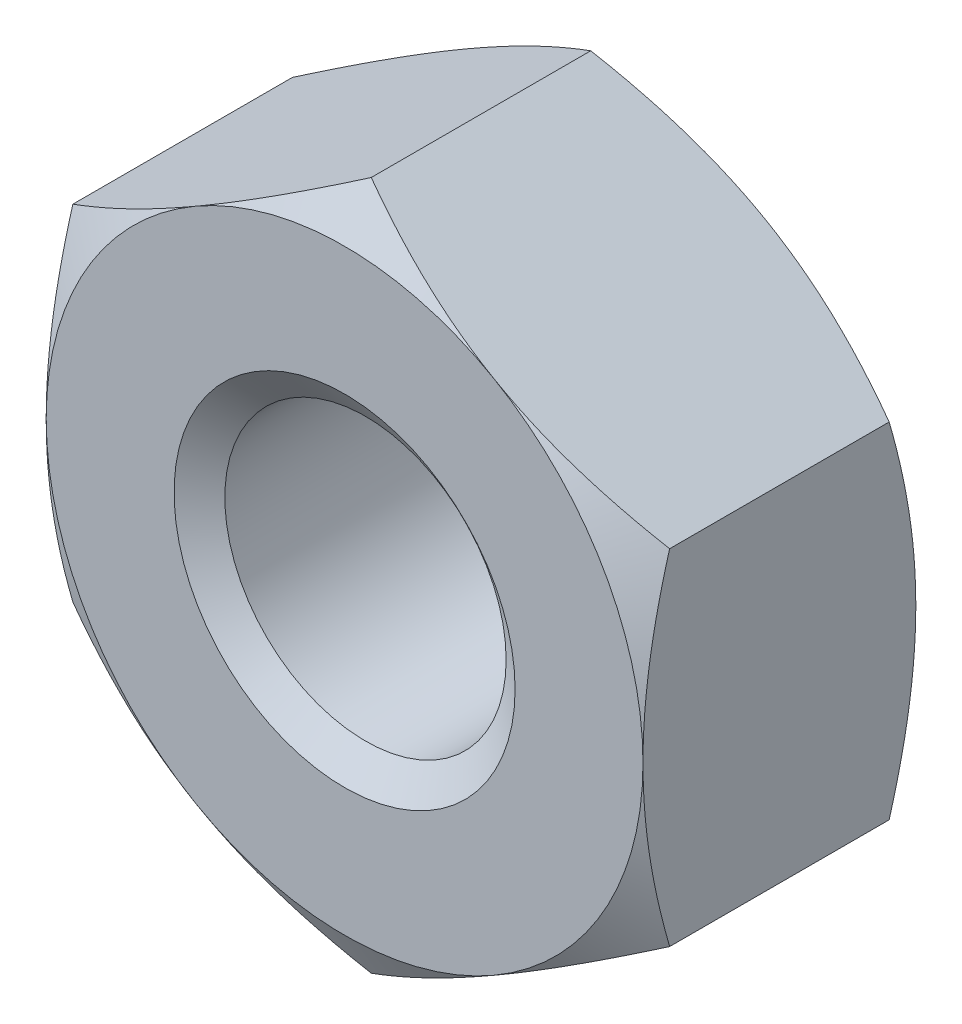
ISO-10303-21;
HEADER;
FILE_DESCRIPTION(('STEP AP214'),'2;1');
FILE_NAME('part.step','',(''),(''),'','','');
FILE_SCHEMA(('AUTOMOTIVE_DESIGN { 1 0 10303 214 1 1 1 1 }'));
ENDSEC;
DATA;
#1=APPLICATION_CONTEXT('core data for automotive mechanical design processes');
#2=APPLICATION_PROTOCOL_DEFINITION('international standard','automotive_design',2000,#1);
#3=PRODUCT_CONTEXT('',#1,'mechanical');
#4=PRODUCT('Part','Part','',(#3));
#5=PRODUCT_RELATED_PRODUCT_CATEGORY('part','',(#4));
#6=PRODUCT_DEFINITION_FORMATION('','',#4);
#7=PRODUCT_DEFINITION_CONTEXT('part definition',#1,'design');
#8=PRODUCT_DEFINITION('design','',#6,#7);
#9=PRODUCT_DEFINITION_SHAPE('','',#8);
#10=(LENGTH_UNIT() NAMED_UNIT(*) SI_UNIT(.MILLI.,.METRE.));
#11=(NAMED_UNIT(*) PLANE_ANGLE_UNIT() SI_UNIT($,.RADIAN.));
#12=(NAMED_UNIT(*) SI_UNIT($,.STERADIAN.) SOLID_ANGLE_UNIT());
#13=UNCERTAINTY_MEASURE_WITH_UNIT(LENGTH_MEASURE(1.E-05),#10,'distance_accuracy_value','');
#14=(GEOMETRIC_REPRESENTATION_CONTEXT(3) GLOBAL_UNCERTAINTY_ASSIGNED_CONTEXT((#13)) GLOBAL_UNIT_ASSIGNED_CONTEXT((#10,
#11,#12)) REPRESENTATION_CONTEXT('',''));
#15=CARTESIAN_POINT('',(0.,0.,0.));
#16=DIRECTION('',(0.,0.,1.));
#17=DIRECTION('',(1.,0.,0.));
#18=AXIS2_PLACEMENT_3D('',#15,#16,#17);
#19=CARTESIAN_POINT('',(0.,0.,-3.2));
#20=DIRECTION('',(0.,0.,1.));
#21=DIRECTION('',(1.,0.,0.));
#22=AXIS2_PLACEMENT_3D('',#19,#20,#21);
#23=CYLINDRICAL_SURFACE('',#22,1.65);
#24=CARTESIAN_POINT('',(0.,0.,-0.245072638373399));
#25=DIRECTION('',(0.,0.,1.));
#26=DIRECTION('',(1.,0.,0.));
#27=AXIS2_PLACEMENT_3D('',#24,#25,#26);
#28=CIRCLE('',#27,1.65);
#29=CARTESIAN_POINT('',(1.65,0.,-0.245072638373399));
#30=VERTEX_POINT('',#29);
#31=EDGE_CURVE('E177',#30,#30,#28,.F.);
#32=ORIENTED_EDGE('',*,*,#31,.F.);
#33=EDGE_LOOP('',(#32));
#34=FACE_BOUND('',#33,.T.);
#35=CARTESIAN_POINT('',(0.,0.,-2.9295273616266));
#36=DIRECTION('',(0.,0.,-1.));
#37=DIRECTION('',(-1.,0.,0.));
#38=AXIS2_PLACEMENT_3D('',#35,#36,#37);
#39=CIRCLE('',#38,1.65);
#40=CARTESIAN_POINT('',(-1.65,0.,-2.9295273616266));
#41=VERTEX_POINT('',#40);
#42=EDGE_CURVE('E41',#41,#41,#39,.F.);
#43=ORIENTED_EDGE('',*,*,#42,.F.);
#44=EDGE_LOOP('',(#43));
#45=FACE_BOUND('',#44,.T.);
#46=ADVANCED_FACE('F36',(#34,#45),#23,.F.);
#47=CARTESIAN_POINT('',(0.,4.04145188432738,-3.2));
#48=DIRECTION('',(-0.5,0.866025403784438,0.));
#49=DIRECTION('',(-0.866025403784438,-0.5,0.));
#50=AXIS2_PLACEMENT_3D('',#47,#48,#49);
#51=PLANE('',#50);
#52=DIRECTION('',(0.,0.,1.));
#53=VECTOR('',#52,1.);
#54=CARTESIAN_POINT('',(-3.5,2.02072594216369,-3.2));
#55=LINE('',#54,#53);
#56=CARTESIAN_POINT('',(-3.5,2.02072594216369,-2.88739260883036));
#57=VERTEX_POINT('',#56);
#58=CARTESIAN_POINT('',(-3.5,2.02072594216369,-0.312607391169644));
#59=VERTEX_POINT('',#58);
#60=EDGE_CURVE('E167',#57,#59,#55,.T.);
#61=ORIENTED_EDGE('',*,*,#60,.T.);
#62=CARTESIAN_POINT('',(-3.5002,2.02061047210985,-0.312674060693372));
#63=CARTESIAN_POINT('',(-3.34639282154755,2.10941108799267,-0.261385788989984));
#64=CARTESIAN_POINT('',(-3.19125798916558,2.19897822522909,-0.214740953816197));
#65=CARTESIAN_POINT('',(-2.87830199342322,2.37966345361545,-0.133321875533349));
#66=CARTESIAN_POINT('',(-2.7204752692125,2.47078475532382,-0.0985764355845613));
#67=CARTESIAN_POINT('',(-2.40677778961987,2.65189807961073,-0.0444900271828358));
#68=CARTESIAN_POINT('',(-2.25095530083931,2.74186223545399,-0.0247890862603812));
#69=CARTESIAN_POINT('',(-1.93857711279463,2.92221386641056,-0.00127013273725395));
#70=CARTESIAN_POINT('',(-1.78202254896577,3.01260068598001,0.00256735545443518));
#71=CARTESIAN_POINT('',(-1.48949078007901,3.1814939814933,-0.00541530187697747));
#72=CARTESIAN_POINT('',(-1.35346978754209,3.26002573814993,-0.0152754340696071));
#73=CARTESIAN_POINT('',(-1.08231397971101,3.41657761679354,-0.0465264668994038));
#74=CARTESIAN_POINT('',(-0.947180102315317,3.49459719728458,-0.0679280432857986));
#75=CARTESIAN_POINT('',(-0.675465207594816,3.65147186489429,-0.121430407880578));
#76=CARTESIAN_POINT('',(-0.538918580721664,3.73030709667644,-0.153757994445088));
#77=CARTESIAN_POINT('',(-0.267861907055498,3.88680174018324,-0.227128933807995));
#78=CARTESIAN_POINT('',(-0.133348387531463,3.96446315689009,-0.268155046569868));
#79=CARTESIAN_POINT('',(0.000200000000000169,4.04156735438122,-0.312674060693373));
#80=B_SPLINE_CURVE_WITH_KNOTS('',3,(#62,#63,#64,#65,#66,#67,#68,#69,#70,#71,#72,#73,#74,#75,#76,
#77,#78,#79),.UNSPECIFIED.,.F.,.F.,(4,2,2,2,2,2,2,2,4),(0.,0.554793832886255,1.11092123814984,
1.65328467083219,2.19498204478403,2.6666513085086,3.13875761298267,3.6213361260051,
4.10296698719187),.UNSPECIFIED.);
#81=CARTESIAN_POINT('',(-1.75,3.03108891324554,0.));
#82=VERTEX_POINT('',#81);
#83=EDGE_CURVE('E63',#59,#82,#80,.T.);
#84=ORIENTED_EDGE('',*,*,#83,.T.);
#85=CARTESIAN_POINT('',(0.,4.04145188432738,-0.312607391169645));
#86=VERTEX_POINT('',#85);
#87=EDGE_CURVE('E246',#82,#86,#80,.T.);
#88=ORIENTED_EDGE('',*,*,#87,.T.);
#89=DIRECTION('',(0.,0.,1.));
#90=VECTOR('',#89,1.);
#91=CARTESIAN_POINT('',(0.,4.04145188432738,-3.2));
#92=LINE('',#91,#90);
#93=CARTESIAN_POINT('',(0.,4.04145188432738,-2.88739260883036));
#94=VERTEX_POINT('',#93);
#95=EDGE_CURVE('E152',#94,#86,#92,.T.);
#96=ORIENTED_EDGE('',*,*,#95,.F.);
#97=CARTESIAN_POINT('',(-3.5002,2.02061047210985,-2.88732593930663));
#98=CARTESIAN_POINT('',(-3.34639282154755,2.10941108799267,-2.93861421101002));
#99=CARTESIAN_POINT('',(-3.19125798916558,2.19897822522909,-2.9852590461838));
#100=CARTESIAN_POINT('',(-2.87830199342322,2.37966345361545,-3.06667812446665));
#101=CARTESIAN_POINT('',(-2.7204752692125,2.47078475532382,-3.10142356441544));
#102=CARTESIAN_POINT('',(-2.40677778961987,2.65189807961073,-3.15550997281716));
#103=CARTESIAN_POINT('',(-2.25095530083931,2.74186223545399,-3.17521091373962));
#104=CARTESIAN_POINT('',(-1.93857711279463,2.92221386641056,-3.19872986726275));
#105=CARTESIAN_POINT('',(-1.78202254896577,3.01260068598001,-3.20256735545444));
#106=CARTESIAN_POINT('',(-1.48949078007901,3.1814939814933,-3.19458469812302));
#107=CARTESIAN_POINT('',(-1.35346978754209,3.26002573814993,-3.18472456593039));
#108=CARTESIAN_POINT('',(-1.082313979711,3.41657761679354,-3.1534735331006));
#109=CARTESIAN_POINT('',(-0.947180102315317,3.49459719728458,-3.1320719567142));
#110=CARTESIAN_POINT('',(-0.675465207594816,3.65147186489429,-3.07856959211942));
#111=CARTESIAN_POINT('',(-0.538918580721664,3.73030709667644,-3.04624200555491));
#112=CARTESIAN_POINT('',(-0.267861907055498,3.88680174018324,-2.972871066192));
#113=CARTESIAN_POINT('',(-0.133348387531463,3.96446315689009,-2.93184495343013));
#114=CARTESIAN_POINT('',(0.000200000000000051,4.04156735438122,-2.88732593930663));
#115=B_SPLINE_CURVE_WITH_KNOTS('',3,(#97,#98,#99,#100,#101,#102,#103,#104,#105,#106,#107,#108,
#109,#110,#111,#112,#113,#114),.UNSPECIFIED.,.F.,.F.,(4,2,2,2,2,2,2,2,4),(0.,0.554793832886254,
1.11092123814984,1.65328467083219,2.19498204478403,2.6666513085086,3.13875761298267,
3.6213361260051,4.10296698719187),.UNSPECIFIED.);
#116=CARTESIAN_POINT('',(-1.75,3.03108891324554,-3.2));
#117=VERTEX_POINT('',#116);
#118=EDGE_CURVE('E170',#117,#94,#115,.T.);
#119=ORIENTED_EDGE('',*,*,#118,.F.);
#120=EDGE_CURVE('E269',#57,#117,#115,.T.);
#121=ORIENTED_EDGE('',*,*,#120,.F.);
#122=EDGE_LOOP('',(#61,#84,#88,#96,#119,#121));
#123=FACE_BOUND('',#122,.T.);
#124=ADVANCED_FACE('F38',(#123),#51,.T.);
#125=CARTESIAN_POINT('',(3.5,2.02072594216369,-3.2));
#126=DIRECTION('',(0.5,0.866025403784438,0.));
#127=DIRECTION('',(-0.866025403784438,0.5,0.));
#128=AXIS2_PLACEMENT_3D('',#125,#126,#127);
#129=PLANE('',#128);
#130=ORIENTED_EDGE('',*,*,#95,.T.);
#131=CARTESIAN_POINT('',(-0.000199999999999658,4.04156735438122,-0.312674060693373));
#132=CARTESIAN_POINT('',(0.15360717845245,3.9527667384984,-0.261385788989984));
#133=CARTESIAN_POINT('',(0.308742010834425,3.86319960126198,-0.214740953816198));
#134=CARTESIAN_POINT('',(0.621698006576782,3.68251437287562,-0.133321875533349));
#135=CARTESIAN_POINT('',(0.779524730787497,3.59139307116725,-0.0985764355845617));
#136=CARTESIAN_POINT('',(1.09322221038013,3.41027974688034,-0.0444900271828359));
#137=CARTESIAN_POINT('',(1.24904469916069,3.32031559103708,-0.0247890862603811));
#138=CARTESIAN_POINT('',(1.56142288720538,3.13996396008051,-0.00127013273725379));
#139=CARTESIAN_POINT('',(1.71797745103423,3.04957714051106,0.00256735545443517));
#140=CARTESIAN_POINT('',(2.01050921992099,2.88068384499777,-0.00541530187697746));
#141=CARTESIAN_POINT('',(2.14653021245791,2.80215208834114,-0.0152754340696069));
#142=CARTESIAN_POINT('',(2.417686020289,2.64560020969753,-0.0465264668994033));
#143=CARTESIAN_POINT('',(2.55281989768468,2.56758062920649,-0.0679280432857979));
#144=CARTESIAN_POINT('',(2.82453479240518,2.41070596159678,-0.121430407880577));
#145=CARTESIAN_POINT('',(2.96108141927834,2.33187072981463,-0.153757994445087));
#146=CARTESIAN_POINT('',(3.2321380929445,2.17537608630783,-0.227128933807995));
#147=CARTESIAN_POINT('',(3.36665161246854,2.09771466960098,-0.268155046569867));
#148=CARTESIAN_POINT('',(3.5002,2.02061047210985,-0.312674060693372));
#149=B_SPLINE_CURVE_WITH_KNOTS('',3,(#131,#132,#133,#134,#135,#136,#137,#138,#139,#140,#141,
#142,#143,#144,#145,#146,#147,#148),.UNSPECIFIED.,.F.,.F.,(4,2,2,2,2,2,2,2,4),(0.,
0.554793832886254,1.11092123814984,1.65328467083219,2.19498204478403,2.6666513085086,
3.13875761298267,3.6213361260051,4.10296698719187),.UNSPECIFIED.);
#150=CARTESIAN_POINT('',(1.75,3.03108891324553,0.));
#151=VERTEX_POINT('',#150);
#152=EDGE_CURVE('E145',#86,#151,#149,.T.);
#153=ORIENTED_EDGE('',*,*,#152,.T.);
#154=CARTESIAN_POINT('',(3.5,2.02072594216369,-0.312607391169645));
#155=VERTEX_POINT('',#154);
#156=EDGE_CURVE('E131',#151,#155,#149,.T.);
#157=ORIENTED_EDGE('',*,*,#156,.T.);
#158=DIRECTION('',(0.,0.,1.));
#159=VECTOR('',#158,1.);
#160=CARTESIAN_POINT('',(3.5,2.02072594216369,-3.2));
#161=LINE('',#160,#159);
#162=CARTESIAN_POINT('',(3.5,2.02072594216369,-2.88739260883036));
#163=VERTEX_POINT('',#162);
#164=EDGE_CURVE('E144',#163,#155,#161,.T.);
#165=ORIENTED_EDGE('',*,*,#164,.F.);
#166=CARTESIAN_POINT('',(-0.000199999999999867,4.04156735438122,-2.88732593930663));
#167=CARTESIAN_POINT('',(0.15360717845245,3.9527667384984,-2.93861421101002));
#168=CARTESIAN_POINT('',(0.308742010834424,3.86319960126198,-2.9852590461838));
#169=CARTESIAN_POINT('',(0.621698006576782,3.68251437287562,-3.06667812446665));
#170=CARTESIAN_POINT('',(0.779524730787497,3.59139307116725,-3.10142356441544));
#171=CARTESIAN_POINT('',(1.09322221038013,3.41027974688034,-3.15550997281716));
#172=CARTESIAN_POINT('',(1.24904469916069,3.32031559103708,-3.17521091373962));
#173=CARTESIAN_POINT('',(1.56142288720538,3.13996396008051,-3.19872986726275));
#174=CARTESIAN_POINT('',(1.71797745103423,3.04957714051106,-3.20256735545444));
#175=CARTESIAN_POINT('',(2.01050921992099,2.88068384499777,-3.19458469812302));
#176=CARTESIAN_POINT('',(2.14653021245791,2.80215208834114,-3.18472456593039));
#177=CARTESIAN_POINT('',(2.417686020289,2.64560020969753,-3.1534735331006));
#178=CARTESIAN_POINT('',(2.55281989768468,2.56758062920649,-3.1320719567142));
#179=CARTESIAN_POINT('',(2.82453479240518,2.41070596159678,-3.07856959211942));
#180=CARTESIAN_POINT('',(2.96108141927834,2.33187072981463,-3.04624200555491));
#181=CARTESIAN_POINT('',(3.2321380929445,2.17537608630783,-2.97287106619201));
#182=CARTESIAN_POINT('',(3.36665161246854,2.09771466960098,-2.93184495343013));
#183=CARTESIAN_POINT('',(3.5002,2.02061047210985,-2.88732593930663));
#184=B_SPLINE_CURVE_WITH_KNOTS('',3,(#166,#167,#168,#169,#170,#171,#172,#173,#174,#175,#176,
#177,#178,#179,#180,#181,#182,#183),.UNSPECIFIED.,.F.,.F.,(4,2,2,2,2,2,2,2,4),(0.,
0.554793832886254,1.11092123814984,1.65328467083219,2.19498204478403,2.6666513085086,
3.13875761298267,3.6213361260051,4.10296698719187),.UNSPECIFIED.);
#185=CARTESIAN_POINT('',(1.75,3.03108891324553,-3.2));
#186=VERTEX_POINT('',#185);
#187=EDGE_CURVE('E262',#186,#163,#184,.T.);
#188=ORIENTED_EDGE('',*,*,#187,.F.);
#189=EDGE_CURVE('E268',#94,#186,#184,.T.);
#190=ORIENTED_EDGE('',*,*,#189,.F.);
#191=EDGE_LOOP('',(#130,#153,#157,#165,#188,#190));
#192=FACE_BOUND('',#191,.T.);
#193=ADVANCED_FACE('F142',(#192),#129,.T.);
#194=CARTESIAN_POINT('',(3.5,2.02072594216369,-3.2));
#195=DIRECTION('',(-1.,0.,0.));
#196=DIRECTION('',(0.,0.,1.));
#197=AXIS2_PLACEMENT_3D('',#194,#195,#196);
#198=PLANE('',#197);
#199=CARTESIAN_POINT('',(3.5,-5.35926299121405,-1.67484346858556));
#200=CARTESIAN_POINT('',(3.5,-5.20559319908841,-1.60058173692104));
#201=CARTESIAN_POINT('',(3.5,-5.05156008083375,-1.52705822833147));
#202=CARTESIAN_POINT('',(3.5,-4.7425707418071,-1.38190950344752));
#203=CARTESIAN_POINT('',(3.5,-4.58761436682436,-1.31028461582133));
#204=CARTESIAN_POINT('',(3.5,-4.27574500225542,-1.16897765517624));
#205=CARTESIAN_POINT('',(3.5,-4.11882589028192,-1.09930904568016));
#206=CARTESIAN_POINT('',(3.5,-3.80369792903855,-0.962964262242761));
#207=CARTESIAN_POINT('',(3.5,-3.64548914750595,-0.896287932319518));
#208=CARTESIAN_POINT('',(3.5,-3.32556618401855,-0.765931819095067));
#209=CARTESIAN_POINT('',(3.5,-3.16383281219923,-0.702298873688865));
#210=CARTESIAN_POINT('',(3.5,-2.83845840945597,-0.580016702089493));
#211=CARTESIAN_POINT('',(3.5,-2.67481716858826,-0.521368030370691));
#212=CARTESIAN_POINT('',(3.5,-2.34570278472049,-0.410630279877021));
#213=CARTESIAN_POINT('',(3.5,-2.18023438248742,-0.358527255435858));
#214=CARTESIAN_POINT('',(3.5,-1.8469452280637,-0.262572936976443));
#215=CARTESIAN_POINT('',(3.5,-1.6791252378753,-0.218719033467158));
#216=CARTESIAN_POINT('',(3.5,-1.34101828610925,-0.141391945584786));
#217=CARTESIAN_POINT('',(3.5,-1.17073068027693,-0.107921525211972));
#218=CARTESIAN_POINT('',(3.5,-0.828102385138483,-0.0536149564320503));
#219=CARTESIAN_POINT('',(3.5,-0.655761694017301,-0.0327788191952363));
#220=CARTESIAN_POINT('',(3.5,-0.311020490924449,-0.00558408650575633));
#221=CARTESIAN_POINT('',(3.5,-0.138627397207259,0.000866163165911625));
#222=CARTESIAN_POINT('',(3.5,0.206038074906536,-0.00105355807794596));
#223=CARTESIAN_POINT('',(3.5,0.37831047302318,-0.00941968196343195));
#224=CARTESIAN_POINT('',(3.5,0.672490555822328,-0.0357688927868922));
#225=CARTESIAN_POINT('',(3.5,0.794722791084093,-0.0503206340384214));
#226=CARTESIAN_POINT('',(3.5,1.0382430543056,-0.0859367340533559));
#227=CARTESIAN_POINT('',(3.5,1.15953093025887,-0.107002119926141));
#228=CARTESIAN_POINT('',(3.5,1.52187914771348,-0.178863187081453));
#229=CARTESIAN_POINT('',(3.5,1.76124104212632,-0.23830527562201));
#230=CARTESIAN_POINT('',(3.5,2.11940971387708,-0.340826814402554));
#231=CARTESIAN_POINT('',(3.5,2.24008344316346,-0.377749699085183));
#232=CARTESIAN_POINT('',(3.5,2.48017139213728,-0.455249007699294));
#233=CARTESIAN_POINT('',(3.5,2.59958641795613,-0.49582291166355));
#234=CARTESIAN_POINT('',(3.5,2.83665760451798,-0.579779986782752));
#235=CARTESIAN_POINT('',(3.5,2.95431988203483,-0.623146060034314));
#236=CARTESIAN_POINT('',(3.5,3.188731535088,-0.712423559566866));
#237=CARTESIAN_POINT('',(3.5,3.30548051959464,-0.75833601459295));
#238=CARTESIAN_POINT('',(3.5,3.42180736613349,-0.805270380724071));
#239=B_SPLINE_CURVE_WITH_KNOTS('',3,(#199,#200,#201,#202,#203,#204,#205,#206,#207,#208,#209,
#210,#211,#212,#213,#214,#215,#216,#217,#218,#219,#220,#221,#222,#223,#224,#225,#226,#227,#228,
#229,#230,#231,#232,#233,#234,#235,#236,#237,#238),.UNSPECIFIED.,.F.,.F.,(4,2,2,2,2,2,2,2,2,2,2,
2,2,2,2,2,2,2,2,4),(0.,0.512025318465738,1.02413870177436,1.53918270315241,2.05419982499223,
2.57553975872798,3.09693761309353,3.617205066104,4.13730766217537,4.65754858684365,
5.17778997146961,5.69470725122282,6.21149033452401,6.58059623222331,6.94976036239485,
7.68863804939851,8.06719621660478,8.4454950747676,8.82166461280099,9.1979872473341),.UNSPECIFIED.);
#240=CARTESIAN_POINT('',(3.5,-2.02072594216369,-0.312607391169645));
#241=VERTEX_POINT('',#240);
#242=CARTESIAN_POINT('',(3.5,0.,0.));
#243=VERTEX_POINT('',#242);
#244=EDGE_CURVE('E137',#241,#243,#239,.T.);
#245=ORIENTED_EDGE('',*,*,#244,.F.);
#246=DIRECTION('',(0.,0.,1.));
#247=VECTOR('',#246,1.);
#248=CARTESIAN_POINT('',(3.5,-2.02072594216369,-3.2));
#249=LINE('',#248,#247);
#250=CARTESIAN_POINT('',(3.5,-2.02072594216369,-2.88739260883036));
#251=VERTEX_POINT('',#250);
#252=EDGE_CURVE('E153',#251,#241,#249,.T.);
#253=ORIENTED_EDGE('',*,*,#252,.F.);
#254=CARTESIAN_POINT('',(3.5,-5.35926299121405,-1.52515653141444));
#255=CARTESIAN_POINT('',(3.5,-5.20559319908841,-1.59941826307896));
#256=CARTESIAN_POINT('',(3.5,-5.05156008083375,-1.67294177166852));
#257=CARTESIAN_POINT('',(3.5,-4.7425707418071,-1.81809049655248));
#258=CARTESIAN_POINT('',(3.5,-4.58761436682436,-1.88971538417867));
#259=CARTESIAN_POINT('',(3.5,-4.27574500225542,-2.03102234482376));
#260=CARTESIAN_POINT('',(3.5,-4.11882589028192,-2.10069095431984));
#261=CARTESIAN_POINT('',(3.5,-3.80369792903855,-2.23703573775724));
#262=CARTESIAN_POINT('',(3.5,-3.64548914750595,-2.30371206768048));
#263=CARTESIAN_POINT('',(3.5,-3.32556618401855,-2.43406818090493));
#264=CARTESIAN_POINT('',(3.5,-3.16383281219923,-2.49770112631114));
#265=CARTESIAN_POINT('',(3.5,-2.83845840945597,-2.61998329791051));
#266=CARTESIAN_POINT('',(3.5,-2.67481716858826,-2.67863196962931));
#267=CARTESIAN_POINT('',(3.5,-2.34570278472049,-2.78936972012298));
#268=CARTESIAN_POINT('',(3.5,-2.18023438248742,-2.84147274456414));
#269=CARTESIAN_POINT('',(3.5,-1.8469452280637,-2.93742706302356));
#270=CARTESIAN_POINT('',(3.5,-1.6791252378753,-2.98128096653284));
#271=CARTESIAN_POINT('',(3.5,-1.34101828610925,-3.05860805441521));
#272=CARTESIAN_POINT('',(3.5,-1.17073068027693,-3.09207847478803));
#273=CARTESIAN_POINT('',(3.5,-0.828102385138484,-3.14638504356795));
#274=CARTESIAN_POINT('',(3.5,-0.655761694017301,-3.16722118080476));
#275=CARTESIAN_POINT('',(3.5,-0.311020490924449,-3.19441591349424));
#276=CARTESIAN_POINT('',(3.5,-0.138627397207259,-3.20086616316591));
#277=CARTESIAN_POINT('',(3.5,0.206038074906536,-3.19894644192205));
#278=CARTESIAN_POINT('',(3.5,0.378310473023181,-3.19058031803657));
#279=CARTESIAN_POINT('',(3.5,0.672490555822328,-3.16423110721311));
#280=CARTESIAN_POINT('',(3.5,0.794722791084093,-3.14967936596158));
#281=CARTESIAN_POINT('',(3.5,1.0382430543056,-3.11406326594664));
#282=CARTESIAN_POINT('',(3.5,1.15953093025887,-3.09299788007386));
#283=CARTESIAN_POINT('',(3.5,1.52187914771348,-3.02113681291855));
#284=CARTESIAN_POINT('',(3.5,1.76124104212632,-2.96169472437799));
#285=CARTESIAN_POINT('',(3.5,2.11940971387708,-2.85917318559745));
#286=CARTESIAN_POINT('',(3.5,2.24008344316346,-2.82225030091482));
#287=CARTESIAN_POINT('',(3.5,2.48017139213728,-2.74475099230071));
#288=CARTESIAN_POINT('',(3.5,2.59958641795613,-2.70417708833645));
#289=CARTESIAN_POINT('',(3.5,2.83665760451798,-2.62022001321725));
#290=CARTESIAN_POINT('',(3.5,2.95431988203483,-2.57685393996569));
#291=CARTESIAN_POINT('',(3.5,3.188731535088,-2.48757644043313));
#292=CARTESIAN_POINT('',(3.5,3.30548051959464,-2.44166398540705));
#293=CARTESIAN_POINT('',(3.5,3.42180736613349,-2.39472961927593));
#294=B_SPLINE_CURVE_WITH_KNOTS('',3,(#254,#255,#256,#257,#258,#259,#260,#261,#262,#263,#264,
#265,#266,#267,#268,#269,#270,#271,#272,#273,#274,#275,#276,#277,#278,#279,#280,#281,#282,#283,
#284,#285,#286,#287,#288,#289,#290,#291,#292,#293),.UNSPECIFIED.,.F.,.F.,(4,2,2,2,2,2,2,2,2,2,2,
2,2,2,2,2,2,2,2,4),(0.,0.512025318465737,1.02413870177436,1.53918270315241,2.05419982499223,
2.57553975872798,3.09693761309353,3.617205066104,4.13730766217537,4.65754858684364,
5.17778997146961,5.69470725122282,6.21149033452401,6.58059623222331,6.94976036239485,
7.68863804939851,8.06719621660478,8.4454950747676,8.82166461280099,9.1979872473341),.UNSPECIFIED.);
#295=CARTESIAN_POINT('',(3.5,0.,-3.2));
#296=VERTEX_POINT('',#295);
#297=EDGE_CURVE('E275',#251,#296,#294,.T.);
#298=ORIENTED_EDGE('',*,*,#297,.T.);
#299=EDGE_CURVE('E151',#296,#163,#294,.T.);
#300=ORIENTED_EDGE('',*,*,#299,.T.);
#301=ORIENTED_EDGE('',*,*,#164,.T.);
#302=EDGE_CURVE('E128',#243,#155,#239,.T.);
#303=ORIENTED_EDGE('',*,*,#302,.F.);
#304=EDGE_LOOP('',(#245,#253,#298,#300,#301,#303));
#305=FACE_BOUND('',#304,.T.);
#306=ADVANCED_FACE('F148',(#305),#198,.F.);
#307=CARTESIAN_POINT('',(0.,-4.04145188432739,-3.2));
#308=DIRECTION('',(0.5,-0.866025403784438,0.));
#309=DIRECTION('',(0.866025403784438,0.5,0.));
#310=AXIS2_PLACEMENT_3D('',#307,#308,#309);
#311=PLANE('',#310);
#312=ORIENTED_EDGE('',*,*,#252,.T.);
#313=CARTESIAN_POINT('',(3.5002,-2.02061047210986,-0.312674060693373));
#314=CARTESIAN_POINT('',(3.34639282154755,-2.10941108799267,-0.261385788989985));
#315=CARTESIAN_POINT('',(3.19125798916558,-2.19897822522909,-0.214740953816198));
#316=CARTESIAN_POINT('',(2.87830199342322,-2.37966345361545,-0.13332187553335));
#317=CARTESIAN_POINT('',(2.7204752692125,-2.47078475532382,-0.0985764355845622));
#318=CARTESIAN_POINT('',(2.40677778961987,-2.65189807961074,-0.0444900271828369));
#319=CARTESIAN_POINT('',(2.25095530083931,-2.741862235454,-0.0247890862603824));
#320=CARTESIAN_POINT('',(1.93857711279462,-2.92221386641056,-0.00127013273725544));
#321=CARTESIAN_POINT('',(1.78202254896577,-3.01260068598001,0.00256735545443363));
#322=CARTESIAN_POINT('',(1.48949078007901,-3.1814939814933,-0.00541530187697917));
#323=CARTESIAN_POINT('',(1.35346978754209,-3.26002573814993,-0.0152754340696088));
#324=CARTESIAN_POINT('',(1.082313979711,-3.41657761679354,-0.0465264668994057));
#325=CARTESIAN_POINT('',(0.947180102315316,-3.49459719728458,-0.0679280432858005));
#326=CARTESIAN_POINT('',(0.675465207594815,-3.65147186489429,-0.12143040788058));
#327=CARTESIAN_POINT('',(0.538918580721663,-3.73030709667644,-0.15375799444509));
#328=CARTESIAN_POINT('',(0.267861907055498,-3.88680174018325,-0.227128933807997));
#329=CARTESIAN_POINT('',(0.133348387531463,-3.96446315689009,-0.26815504656987));
#330=CARTESIAN_POINT('',(-0.000200000000000342,-4.04156735438122,-0.312674060693374));
#331=B_SPLINE_CURVE_WITH_KNOTS('',3,(#313,#314,#315,#316,#317,#318,#319,#320,#321,#322,#323,
#324,#325,#326,#327,#328,#329,#330),.UNSPECIFIED.,.F.,.F.,(4,2,2,2,2,2,2,2,4),(0.,
0.554793832886255,1.11092123814984,1.65328467083219,2.19498204478403,2.6666513085086,
3.13875761298267,3.6213361260051,4.10296698719187),.UNSPECIFIED.);
#332=CARTESIAN_POINT('',(1.75,-3.03108891324553,0.));
#333=VERTEX_POINT('',#332);
#334=EDGE_CURVE('E550',#241,#333,#331,.T.);
#335=ORIENTED_EDGE('',*,*,#334,.T.);
#336=CARTESIAN_POINT('',(0.,-4.04145188432738,-0.312607391169645));
#337=VERTEX_POINT('',#336);
#338=EDGE_CURVE('E230',#333,#337,#331,.T.);
#339=ORIENTED_EDGE('',*,*,#338,.T.);
#340=DIRECTION('',(0.,0.,1.));
#341=VECTOR('',#340,1.);
#342=CARTESIAN_POINT('',(0.,-4.04145188432739,-3.2));
#343=LINE('',#342,#341);
#344=CARTESIAN_POINT('',(0.,-4.04145188432738,-2.88739260883036));
#345=VERTEX_POINT('',#344);
#346=EDGE_CURVE('E158',#345,#337,#343,.T.);
#347=ORIENTED_EDGE('',*,*,#346,.F.);
#348=CARTESIAN_POINT('',(3.5002,-2.02061047210986,-2.88732593930663));
#349=CARTESIAN_POINT('',(3.34639282154755,-2.10941108799267,-2.93861421101002));
#350=CARTESIAN_POINT('',(3.19125798916558,-2.19897822522909,-2.9852590461838));
#351=CARTESIAN_POINT('',(2.87830199342322,-2.37966345361545,-3.06667812446665));
#352=CARTESIAN_POINT('',(2.7204752692125,-2.47078475532382,-3.10142356441544));
#353=CARTESIAN_POINT('',(2.40677778961987,-2.65189807961074,-3.15550997281716));
#354=CARTESIAN_POINT('',(2.25095530083931,-2.741862235454,-3.17521091373962));
#355=CARTESIAN_POINT('',(1.93857711279462,-2.92221386641056,-3.19872986726274));
#356=CARTESIAN_POINT('',(1.78202254896577,-3.01260068598001,-3.20256735545443));
#357=CARTESIAN_POINT('',(1.48949078007901,-3.1814939814933,-3.19458469812302));
#358=CARTESIAN_POINT('',(1.35346978754209,-3.26002573814993,-3.18472456593039));
#359=CARTESIAN_POINT('',(1.082313979711,-3.41657761679354,-3.15347353310059));
#360=CARTESIAN_POINT('',(0.947180102315316,-3.49459719728458,-3.1320719567142));
#361=CARTESIAN_POINT('',(0.675465207594815,-3.65147186489429,-3.07856959211942));
#362=CARTESIAN_POINT('',(0.538918580721663,-3.73030709667644,-3.04624200555491));
#363=CARTESIAN_POINT('',(0.267861907055498,-3.88680174018325,-2.972871066192));
#364=CARTESIAN_POINT('',(0.133348387531463,-3.96446315689009,-2.93184495343013));
#365=CARTESIAN_POINT('',(-0.000200000000000337,-4.04156735438122,-2.88732593930663));
#366=B_SPLINE_CURVE_WITH_KNOTS('',3,(#348,#349,#350,#351,#352,#353,#354,#355,#356,#357,#358,
#359,#360,#361,#362,#363,#364,#365),.UNSPECIFIED.,.F.,.F.,(4,2,2,2,2,2,2,2,4),(0.,
0.554793832886255,1.11092123814984,1.65328467083219,2.19498204478403,2.6666513085086,
3.13875761298267,3.6213361260051,4.10296698719187),.UNSPECIFIED.);
#367=CARTESIAN_POINT('',(1.75,-3.03108891324553,-3.2));
#368=VERTEX_POINT('',#367);
#369=EDGE_CURVE('E282',#368,#345,#366,.T.);
#370=ORIENTED_EDGE('',*,*,#369,.F.);
#371=EDGE_CURVE('E281',#251,#368,#366,.T.);
#372=ORIENTED_EDGE('',*,*,#371,.F.);
#373=EDGE_LOOP('',(#312,#335,#339,#347,#370,#372));
#374=FACE_BOUND('',#373,.T.);
#375=ADVANCED_FACE('F294',(#374),#311,.T.);
#376=CARTESIAN_POINT('',(-3.5,-2.02072594216369,-3.2));
#377=DIRECTION('',(-0.500000000000001,-0.866025403784438,0.));
#378=DIRECTION('',(0.866025403784438,-0.500000000000001,0.));
#379=AXIS2_PLACEMENT_3D('',#376,#377,#378);
#380=PLANE('',#379);
#381=ORIENTED_EDGE('',*,*,#346,.T.);
#382=CARTESIAN_POINT('',(0.000199999999999979,-4.04156735438122,-0.312674060693375));
#383=CARTESIAN_POINT('',(-0.15360717845245,-3.9527667384984,-0.261385788989986));
#384=CARTESIAN_POINT('',(-0.308742010834424,-3.86319960126198,-0.2147409538162));
#385=CARTESIAN_POINT('',(-0.621698006576782,-3.68251437287563,-0.133321875533351));
#386=CARTESIAN_POINT('',(-0.779524730787497,-3.59139307116725,-0.0985764355845634));
#387=CARTESIAN_POINT('',(-1.09322221038013,-3.41027974688034,-0.0444900271828377));
#388=CARTESIAN_POINT('',(-1.24904469916069,-3.32031559103708,-0.0247890862603829));
#389=CARTESIAN_POINT('',(-1.56142288720538,-3.13996396008052,-0.00127013273725548));
#390=CARTESIAN_POINT('',(-1.71797745103423,-3.04957714051106,0.00256735545443358));
#391=CARTESIAN_POINT('',(-2.01050921992099,-2.88068384499777,-0.00541530187697888));
#392=CARTESIAN_POINT('',(-2.14653021245791,-2.80215208834114,-0.0152754340696083));
#393=CARTESIAN_POINT('',(-2.417686020289,-2.64560020969754,-0.0465264668994047));
#394=CARTESIAN_POINT('',(-2.55281989768468,-2.5675806292065,-0.0679280432857995));
#395=CARTESIAN_POINT('',(-2.82453479240519,-2.41070596159679,-0.121430407880579));
#396=CARTESIAN_POINT('',(-2.96108141927834,-2.33187072981464,-0.153757994445088));
#397=CARTESIAN_POINT('',(-3.2321380929445,-2.17537608630783,-0.227128933807996));
#398=CARTESIAN_POINT('',(-3.36665161246854,-2.09771466960099,-0.268155046569868));
#399=CARTESIAN_POINT('',(-3.5002,-2.02061047210985,-0.312674060693372));
#400=B_SPLINE_CURVE_WITH_KNOTS('',3,(#382,#383,#384,#385,#386,#387,#388,#389,#390,#391,#392,
#393,#394,#395,#396,#397,#398,#399),.UNSPECIFIED.,.F.,.F.,(4,2,2,2,2,2,2,2,4),(0.,
0.554793832886255,1.11092123814984,1.65328467083219,2.19498204478404,2.6666513085086,
3.13875761298268,3.6213361260051,4.10296698719187),.UNSPECIFIED.);
#401=CARTESIAN_POINT('',(-1.75,-3.03108891324553,0.));
#402=VERTEX_POINT('',#401);
#403=EDGE_CURVE('E548',#337,#402,#400,.T.);
#404=ORIENTED_EDGE('',*,*,#403,.T.);
#405=CARTESIAN_POINT('',(-3.5,-2.02072594216369,-0.312607391169645));
#406=VERTEX_POINT('',#405);
#407=EDGE_CURVE('E202',#402,#406,#400,.T.);
#408=ORIENTED_EDGE('',*,*,#407,.T.);
#409=DIRECTION('',(0.,0.,1.));
#410=VECTOR('',#409,1.);
#411=CARTESIAN_POINT('',(-3.5,-2.02072594216369,-3.2));
#412=LINE('',#411,#410);
#413=CARTESIAN_POINT('',(-3.5,-2.02072594216369,-2.88739260883036));
#414=VERTEX_POINT('',#413);
#415=EDGE_CURVE('E164',#414,#406,#412,.T.);
#416=ORIENTED_EDGE('',*,*,#415,.F.);
#417=CARTESIAN_POINT('',(0.00019999999999995,-4.04156735438122,-2.88732593930663));
#418=CARTESIAN_POINT('',(-0.15360717845245,-3.9527667384984,-2.93861421101001));
#419=CARTESIAN_POINT('',(-0.308742010834424,-3.86319960126198,-2.9852590461838));
#420=CARTESIAN_POINT('',(-0.621698006576782,-3.68251437287563,-3.06667812446665));
#421=CARTESIAN_POINT('',(-0.779524730787497,-3.59139307116725,-3.10142356441544));
#422=CARTESIAN_POINT('',(-1.09322221038013,-3.41027974688034,-3.15550997281716));
#423=CARTESIAN_POINT('',(-1.24904469916069,-3.32031559103708,-3.17521091373962));
#424=CARTESIAN_POINT('',(-1.56142288720538,-3.13996396008052,-3.19872986726275));
#425=CARTESIAN_POINT('',(-1.71797745103423,-3.04957714051106,-3.20256735545443));
#426=CARTESIAN_POINT('',(-2.01050921992099,-2.88068384499777,-3.19458469812302));
#427=CARTESIAN_POINT('',(-2.14653021245791,-2.80215208834115,-3.18472456593039));
#428=CARTESIAN_POINT('',(-2.417686020289,-2.64560020969754,-3.1534735331006));
#429=CARTESIAN_POINT('',(-2.55281989768468,-2.5675806292065,-3.1320719567142));
#430=CARTESIAN_POINT('',(-2.82453479240518,-2.41070596159679,-3.07856959211942));
#431=CARTESIAN_POINT('',(-2.96108141927834,-2.33187072981464,-3.04624200555491));
#432=CARTESIAN_POINT('',(-3.2321380929445,-2.17537608630783,-2.972871066192));
#433=CARTESIAN_POINT('',(-3.36665161246854,-2.09771466960098,-2.93184495343013));
#434=CARTESIAN_POINT('',(-3.5002,-2.02061047210985,-2.88732593930663));
#435=B_SPLINE_CURVE_WITH_KNOTS('',3,(#417,#418,#419,#420,#421,#422,#423,#424,#425,#426,#427,
#428,#429,#430,#431,#432,#433,#434),.UNSPECIFIED.,.F.,.F.,(4,2,2,2,2,2,2,2,4),(0.,
0.554793832886255,1.11092123814984,1.65328467083219,2.19498204478403,2.6666513085086,
3.13875761298268,3.6213361260051,4.10296698719187),.UNSPECIFIED.);
#436=CARTESIAN_POINT('',(-1.75,-3.03108891324553,-3.2));
#437=VERTEX_POINT('',#436);
#438=EDGE_CURVE('E289',#437,#414,#435,.T.);
#439=ORIENTED_EDGE('',*,*,#438,.F.);
#440=EDGE_CURVE('E288',#345,#437,#435,.T.);
#441=ORIENTED_EDGE('',*,*,#440,.F.);
#442=EDGE_LOOP('',(#381,#404,#408,#416,#439,#441));
#443=FACE_BOUND('',#442,.T.);
#444=ADVANCED_FACE('F297',(#443),#380,.T.);
#445=CARTESIAN_POINT('',(-3.5,2.02072594216369,-3.2));
#446=DIRECTION('',(-1.,0.,0.));
#447=DIRECTION('',(0.,0.,1.));
#448=AXIS2_PLACEMENT_3D('',#445,#446,#447);
#449=PLANE('',#448);
#450=ORIENTED_EDGE('',*,*,#415,.T.);
#451=CARTESIAN_POINT('',(-3.5,-5.35926299121405,-1.67484346858556));
#452=CARTESIAN_POINT('',(-3.5,-5.20559319908842,-1.60058173692104));
#453=CARTESIAN_POINT('',(-3.5,-5.05156008083375,-1.52705822833147));
#454=CARTESIAN_POINT('',(-3.5,-4.7425707418071,-1.38190950344752));
#455=CARTESIAN_POINT('',(-3.5,-4.58761436682436,-1.31028461582133));
#456=CARTESIAN_POINT('',(-3.5,-4.27574500225542,-1.16897765517624));
#457=CARTESIAN_POINT('',(-3.5,-4.11882589028192,-1.09930904568016));
#458=CARTESIAN_POINT('',(-3.5,-3.80369792903855,-0.962964262242761));
#459=CARTESIAN_POINT('',(-3.5,-3.64548914750595,-0.896287932319518));
#460=CARTESIAN_POINT('',(-3.5,-3.32556618401855,-0.765931819095068));
#461=CARTESIAN_POINT('',(-3.5,-3.16383281219923,-0.702298873688865));
#462=CARTESIAN_POINT('',(-3.5,-2.83845840945597,-0.580016702089493));
#463=CARTESIAN_POINT('',(-3.5,-2.67481716858826,-0.521368030370692));
#464=CARTESIAN_POINT('',(-3.5,-2.34570278472049,-0.410630279877022));
#465=CARTESIAN_POINT('',(-3.5,-2.18023438248742,-0.358527255435858));
#466=CARTESIAN_POINT('',(-3.5,-1.8469452280637,-0.262572936976443));
#467=CARTESIAN_POINT('',(-3.5,-1.6791252378753,-0.218719033467158));
#468=CARTESIAN_POINT('',(-3.5,-1.34101828610925,-0.141391945584787));
#469=CARTESIAN_POINT('',(-3.5,-1.17073068027693,-0.107921525211972));
#470=CARTESIAN_POINT('',(-3.5,-0.828102385138483,-0.0536149564320502));
#471=CARTESIAN_POINT('',(-3.5,-0.655761694017301,-0.0327788191952362));
#472=CARTESIAN_POINT('',(-3.5,-0.311020490924449,-0.00558408650575643));
#473=CARTESIAN_POINT('',(-3.5,-0.138627397207258,0.000866163165911355));
#474=CARTESIAN_POINT('',(-3.5,0.206038074906536,-0.00105355807794619));
#475=CARTESIAN_POINT('',(-3.5,0.378310473023181,-0.00941968196343197));
#476=CARTESIAN_POINT('',(-3.5,0.672490555822329,-0.0357688927868921));
#477=CARTESIAN_POINT('',(-3.5,0.794722791084093,-0.0503206340384214));
#478=CARTESIAN_POINT('',(-3.5,1.0382430543056,-0.0859367340533558));
#479=CARTESIAN_POINT('',(-3.5,1.15953093025887,-0.107002119926141));
#480=CARTESIAN_POINT('',(-3.5,1.52187914771348,-0.178863187081453));
#481=CARTESIAN_POINT('',(-3.5,1.76124104212632,-0.23830527562201));
#482=CARTESIAN_POINT('',(-3.5,2.11940971387708,-0.340826814402554));
#483=CARTESIAN_POINT('',(-3.5,2.24008344316346,-0.377749699085183));
#484=CARTESIAN_POINT('',(-3.5,2.48017139213728,-0.455249007699294));
#485=CARTESIAN_POINT('',(-3.5,2.59958641795613,-0.49582291166355));
#486=CARTESIAN_POINT('',(-3.5,2.83665760451798,-0.579779986782752));
#487=CARTESIAN_POINT('',(-3.5,2.95431988203483,-0.623146060034314));
#488=CARTESIAN_POINT('',(-3.5,3.188731535088,-0.712423559566866));
#489=CARTESIAN_POINT('',(-3.5,3.30548051959464,-0.75833601459295));
#490=CARTESIAN_POINT('',(-3.5,3.42180736613349,-0.805270380724071));
#491=B_SPLINE_CURVE_WITH_KNOTS('',3,(#451,#452,#453,#454,#455,#456,#457,#458,#459,#460,#461,
#462,#463,#464,#465,#466,#467,#468,#469,#470,#471,#472,#473,#474,#475,#476,#477,#478,#479,#480,
#481,#482,#483,#484,#485,#486,#487,#488,#489,#490),.UNSPECIFIED.,.F.,.F.,(4,2,2,2,2,2,2,2,2,2,2,
2,2,2,2,2,2,2,2,4),(0.,0.512025318465737,1.02413870177436,1.53918270315241,2.05419982499223,
2.57553975872798,3.09693761309353,3.617205066104,4.13730766217537,4.65754858684364,
5.17778997146961,5.69470725122282,6.21149033452401,6.58059623222331,6.94976036239485,
7.68863804939851,8.06719621660478,8.4454950747676,8.82166461280098,9.1979872473341),.UNSPECIFIED.);
#492=CARTESIAN_POINT('',(-3.5,0.,0.));
#493=VERTEX_POINT('',#492);
#494=EDGE_CURVE('E201',#406,#493,#491,.T.);
#495=ORIENTED_EDGE('',*,*,#494,.T.);
#496=EDGE_CURVE('E194',#493,#59,#491,.T.);
#497=ORIENTED_EDGE('',*,*,#496,.T.);
#498=ORIENTED_EDGE('',*,*,#60,.F.);
#499=CARTESIAN_POINT('',(-3.5,-5.35926299121405,-1.52515653141444));
#500=CARTESIAN_POINT('',(-3.5,-5.20559319908842,-1.59941826307896));
#501=CARTESIAN_POINT('',(-3.5,-5.05156008083375,-1.67294177166853));
#502=CARTESIAN_POINT('',(-3.5,-4.7425707418071,-1.81809049655248));
#503=CARTESIAN_POINT('',(-3.5,-4.58761436682436,-1.88971538417867));
#504=CARTESIAN_POINT('',(-3.5,-4.27574500225542,-2.03102234482376));
#505=CARTESIAN_POINT('',(-3.5,-4.11882589028192,-2.10069095431984));
#506=CARTESIAN_POINT('',(-3.5,-3.80369792903855,-2.23703573775724));
#507=CARTESIAN_POINT('',(-3.5,-3.64548914750595,-2.30371206768048));
#508=CARTESIAN_POINT('',(-3.5,-3.32556618401855,-2.43406818090493));
#509=CARTESIAN_POINT('',(-3.5,-3.16383281219923,-2.49770112631114));
#510=CARTESIAN_POINT('',(-3.5,-2.83845840945597,-2.61998329791051));
#511=CARTESIAN_POINT('',(-3.5,-2.67481716858826,-2.67863196962931));
#512=CARTESIAN_POINT('',(-3.5,-2.34570278472049,-2.78936972012298));
#513=CARTESIAN_POINT('',(-3.5,-2.18023438248742,-2.84147274456414));
#514=CARTESIAN_POINT('',(-3.5,-1.8469452280637,-2.93742706302356));
#515=CARTESIAN_POINT('',(-3.5,-1.6791252378753,-2.98128096653284));
#516=CARTESIAN_POINT('',(-3.5,-1.34101828610925,-3.05860805441521));
#517=CARTESIAN_POINT('',(-3.5,-1.17073068027693,-3.09207847478803));
#518=CARTESIAN_POINT('',(-3.5,-0.828102385138483,-3.14638504356795));
#519=CARTESIAN_POINT('',(-3.5,-0.655761694017301,-3.16722118080476));
#520=CARTESIAN_POINT('',(-3.5,-0.311020490924449,-3.19441591349424));
#521=CARTESIAN_POINT('',(-3.5,-0.138627397207258,-3.20086616316591));
#522=CARTESIAN_POINT('',(-3.5,0.206038074906536,-3.19894644192205));
#523=CARTESIAN_POINT('',(-3.5,0.378310473023181,-3.19058031803657));
#524=CARTESIAN_POINT('',(-3.5,0.672490555822328,-3.16423110721311));
#525=CARTESIAN_POINT('',(-3.5,0.794722791084093,-3.14967936596158));
#526=CARTESIAN_POINT('',(-3.5,1.0382430543056,-3.11406326594664));
#527=CARTESIAN_POINT('',(-3.5,1.15953093025887,-3.09299788007386));
#528=CARTESIAN_POINT('',(-3.5,1.52187914771348,-3.02113681291855));
#529=CARTESIAN_POINT('',(-3.5,1.76124104212632,-2.96169472437799));
#530=CARTESIAN_POINT('',(-3.5,2.11940971387708,-2.85917318559745));
#531=CARTESIAN_POINT('',(-3.5,2.24008344316346,-2.82225030091482));
#532=CARTESIAN_POINT('',(-3.5,2.48017139213728,-2.74475099230071));
#533=CARTESIAN_POINT('',(-3.5,2.59958641795613,-2.70417708833645));
#534=CARTESIAN_POINT('',(-3.5,2.83665760451798,-2.62022001321725));
#535=CARTESIAN_POINT('',(-3.5,2.95431988203483,-2.57685393996569));
#536=CARTESIAN_POINT('',(-3.5,3.188731535088,-2.48757644043313));
#537=CARTESIAN_POINT('',(-3.5,3.30548051959464,-2.44166398540705));
#538=CARTESIAN_POINT('',(-3.5,3.42180736613349,-2.39472961927593));
#539=B_SPLINE_CURVE_WITH_KNOTS('',3,(#499,#500,#501,#502,#503,#504,#505,#506,#507,#508,#509,
#510,#511,#512,#513,#514,#515,#516,#517,#518,#519,#520,#521,#522,#523,#524,#525,#526,#527,#528,
#529,#530,#531,#532,#533,#534,#535,#536,#537,#538),.UNSPECIFIED.,.F.,.F.,(4,2,2,2,2,2,2,2,2,2,2,
2,2,2,2,2,2,2,2,4),(0.,0.512025318465737,1.02413870177436,1.53918270315241,2.05419982499223,
2.57553975872798,3.09693761309353,3.617205066104,4.13730766217537,4.65754858684365,
5.17778997146961,5.69470725122282,6.21149033452401,6.58059623222331,6.94976036239485,
7.68863804939851,8.06719621660478,8.4454950747676,8.82166461280099,9.1979872473341),.UNSPECIFIED.);
#540=CARTESIAN_POINT('',(-3.5,0.,-3.2));
#541=VERTEX_POINT('',#540);
#542=EDGE_CURVE('E336',#541,#57,#539,.T.);
#543=ORIENTED_EDGE('',*,*,#542,.F.);
#544=EDGE_CURVE('E351',#414,#541,#539,.T.);
#545=ORIENTED_EDGE('',*,*,#544,.F.);
#546=EDGE_LOOP('',(#450,#495,#497,#498,#543,#545));
#547=FACE_BOUND('',#546,.T.);
#548=ADVANCED_FACE('F209',(#547),#449,.T.);
#549=CARTESIAN_POINT('',(-7.,0.,0.));
#550=DIRECTION('',(0.,0.,1.));
#551=DIRECTION('',(1.,0.,0.));
#552=AXIS2_PLACEMENT_3D('',#549,#550,#551);
#553=PLANE('',#552);
#554=CARTESIAN_POINT('',(0.,0.,0.));
#555=DIRECTION('',(0.,0.,1.));
#556=DIRECTION('',(1.,0.,0.));
#557=AXIS2_PLACEMENT_3D('',#554,#555,#556);
#558=CIRCLE('',#557,2.);
#559=CARTESIAN_POINT('',(2.,0.,0.));
#560=VERTEX_POINT('',#559);
#561=EDGE_CURVE('E179',#560,#560,#558,.T.);
#562=ORIENTED_EDGE('',*,*,#561,.F.);
#563=EDGE_LOOP('',(#562));
#564=FACE_BOUND('',#563,.T.);
#565=CARTESIAN_POINT('',(0.,0.,0.));
#566=DIRECTION('',(0.,0.,1.));
#567=DIRECTION('',(1.,0.,0.));
#568=AXIS2_PLACEMENT_3D('',#565,#566,#567);
#569=CIRCLE('',#568,3.5);
#570=EDGE_CURVE('E48',#333,#243,#569,.T.);
#571=ORIENTED_EDGE('',*,*,#570,.T.);
#572=CARTESIAN_POINT('',(0.,0.,0.));
#573=DIRECTION('',(0.,0.,1.));
#574=DIRECTION('',(1.,0.,0.));
#575=AXIS2_PLACEMENT_3D('',#572,#573,#574);
#576=CIRCLE('',#575,3.5);
#577=EDGE_CURVE('E55',#243,#151,#576,.T.);
#578=ORIENTED_EDGE('',*,*,#577,.T.);
#579=EDGE_CURVE('E11',#151,#82,#569,.T.);
#580=ORIENTED_EDGE('',*,*,#579,.T.);
#581=EDGE_CURVE('E46',#82,#493,#569,.T.);
#582=ORIENTED_EDGE('',*,*,#581,.T.);
#583=EDGE_CURVE('E372',#493,#402,#569,.T.);
#584=ORIENTED_EDGE('',*,*,#583,.T.);
#585=EDGE_CURVE('E176',#402,#333,#569,.T.);
#586=ORIENTED_EDGE('',*,*,#585,.T.);
#587=EDGE_LOOP('',(#571,#578,#580,#582,#584,#586));
#588=FACE_BOUND('',#587,.T.);
#589=ADVANCED_FACE('F258',(#564,#588),#553,.T.);
#590=CARTESIAN_POINT('',(-7.,0.,-3.2));
#591=DIRECTION('',(0.,0.,1.));
#592=DIRECTION('',(1.,0.,0.));
#593=AXIS2_PLACEMENT_3D('',#590,#591,#592);
#594=PLANE('',#593);
#595=CARTESIAN_POINT('',(0.,0.,-3.2));
#596=DIRECTION('',(0.,0.,1.));
#597=DIRECTION('',(1.,0.,0.));
#598=AXIS2_PLACEMENT_3D('',#595,#596,#597);
#599=CIRCLE('',#598,2.);
#600=CARTESIAN_POINT('',(2.,0.,-3.2));
#601=VERTEX_POINT('',#600);
#602=EDGE_CURVE('E180',#601,#601,#599,.F.);
#603=ORIENTED_EDGE('',*,*,#602,.F.);
#604=EDGE_LOOP('',(#603));
#605=FACE_BOUND('',#604,.T.);
#606=CARTESIAN_POINT('',(0.,0.,-3.2));
#607=DIRECTION('',(0.,0.,1.));
#608=DIRECTION('',(1.,0.,0.));
#609=AXIS2_PLACEMENT_3D('',#606,#607,#608);
#610=CIRCLE('',#609,3.5);
#611=EDGE_CURVE('E253',#296,#186,#610,.T.);
#612=ORIENTED_EDGE('',*,*,#611,.F.);
#613=CARTESIAN_POINT('',(0.,0.,-3.2));
#614=DIRECTION('',(0.,0.,1.));
#615=DIRECTION('',(1.,0.,0.));
#616=AXIS2_PLACEMENT_3D('',#613,#614,#615);
#617=CIRCLE('',#616,3.5);
#618=EDGE_CURVE('E171',#296,#368,#617,.F.);
#619=ORIENTED_EDGE('',*,*,#618,.T.);
#620=EDGE_CURVE('E173',#368,#437,#617,.F.);
#621=ORIENTED_EDGE('',*,*,#620,.T.);
#622=EDGE_CURVE('E381',#437,#541,#617,.F.);
#623=ORIENTED_EDGE('',*,*,#622,.T.);
#624=EDGE_CURVE('E364',#541,#117,#617,.F.);
#625=ORIENTED_EDGE('',*,*,#624,.T.);
#626=EDGE_CURVE('E155',#117,#186,#617,.F.);
#627=ORIENTED_EDGE('',*,*,#626,.T.);
#628=EDGE_LOOP('',(#612,#619,#621,#623,#625,#627));
#629=FACE_BOUND('',#628,.T.);
#630=ADVANCED_FACE('F316',(#605,#629),#594,.F.);
#631=CARTESIAN_POINT('',(0.,0.,-3.2));
#632=DIRECTION('',(0.,0.,1.));
#633=DIRECTION('',(1.,0.,0.));
#634=AXIS2_PLACEMENT_3D('',#631,#632,#633);
#635=CONICAL_SURFACE('',#634,3.5,1.0471975511966);
#636=ORIENTED_EDGE('',*,*,#187,.T.);
#637=ORIENTED_EDGE('',*,*,#299,.F.);
#638=ORIENTED_EDGE('',*,*,#611,.T.);
#639=EDGE_LOOP('',(#636,#637,#638));
#640=FACE_BOUND('',#639,.T.);
#641=ADVANCED_FACE('F318',(#640),#635,.T.);
#642=ORIENTED_EDGE('',*,*,#118,.T.);
#643=ORIENTED_EDGE('',*,*,#189,.T.);
#644=ORIENTED_EDGE('',*,*,#626,.F.);
#645=EDGE_LOOP('',(#642,#643,#644));
#646=FACE_BOUND('',#645,.T.);
#647=ADVANCED_FACE('F324',(#646),#635,.T.);
#648=ORIENTED_EDGE('',*,*,#120,.T.);
#649=ORIENTED_EDGE('',*,*,#624,.F.);
#650=ORIENTED_EDGE('',*,*,#542,.T.);
#651=EDGE_LOOP('',(#648,#649,#650));
#652=FACE_BOUND('',#651,.T.);
#653=ADVANCED_FACE('F363',(#652),#635,.T.);
#654=ORIENTED_EDGE('',*,*,#438,.T.);
#655=ORIENTED_EDGE('',*,*,#544,.T.);
#656=ORIENTED_EDGE('',*,*,#622,.F.);
#657=EDGE_LOOP('',(#654,#655,#656));
#658=FACE_BOUND('',#657,.T.);
#659=ADVANCED_FACE('F222',(#658),#635,.T.);
#660=ORIENTED_EDGE('',*,*,#369,.T.);
#661=ORIENTED_EDGE('',*,*,#440,.T.);
#662=ORIENTED_EDGE('',*,*,#620,.F.);
#663=EDGE_LOOP('',(#660,#661,#662));
#664=FACE_BOUND('',#663,.T.);
#665=ADVANCED_FACE('F346',(#664),#635,.T.);
#666=ORIENTED_EDGE('',*,*,#371,.T.);
#667=ORIENTED_EDGE('',*,*,#618,.F.);
#668=ORIENTED_EDGE('',*,*,#297,.F.);
#669=EDGE_LOOP('',(#666,#667,#668));
#670=FACE_BOUND('',#669,.T.);
#671=ADVANCED_FACE('F326',(#670),#635,.T.);
#672=CARTESIAN_POINT('',(0.,0.,0.));
#673=DIRECTION('',(0.,0.,-1.));
#674=DIRECTION('',(-1.,0.,0.));
#675=AXIS2_PLACEMENT_3D('',#672,#673,#674);
#676=CONICAL_SURFACE('',#675,3.5,1.0471975511966);
#677=ORIENTED_EDGE('',*,*,#244,.T.);
#678=ORIENTED_EDGE('',*,*,#570,.F.);
#679=ORIENTED_EDGE('',*,*,#334,.F.);
#680=EDGE_LOOP('',(#677,#678,#679));
#681=FACE_BOUND('',#680,.T.);
#682=ADVANCED_FACE('F415',(#681),#676,.T.);
#683=ORIENTED_EDGE('',*,*,#585,.F.);
#684=ORIENTED_EDGE('',*,*,#403,.F.);
#685=ORIENTED_EDGE('',*,*,#338,.F.);
#686=EDGE_LOOP('',(#683,#684,#685));
#687=FACE_BOUND('',#686,.T.);
#688=ADVANCED_FACE('F217',(#687),#676,.T.);
#689=ORIENTED_EDGE('',*,*,#583,.F.);
#690=ORIENTED_EDGE('',*,*,#494,.F.);
#691=ORIENTED_EDGE('',*,*,#407,.F.);
#692=EDGE_LOOP('',(#689,#690,#691));
#693=FACE_BOUND('',#692,.T.);
#694=ADVANCED_FACE('F211',(#693),#676,.T.);
#695=ORIENTED_EDGE('',*,*,#496,.F.);
#696=ORIENTED_EDGE('',*,*,#581,.F.);
#697=ORIENTED_EDGE('',*,*,#83,.F.);
#698=EDGE_LOOP('',(#695,#696,#697));
#699=FACE_BOUND('',#698,.T.);
#700=ADVANCED_FACE('F216',(#699),#676,.T.);
#701=ORIENTED_EDGE('',*,*,#579,.F.);
#702=ORIENTED_EDGE('',*,*,#152,.F.);
#703=ORIENTED_EDGE('',*,*,#87,.F.);
#704=EDGE_LOOP('',(#701,#702,#703));
#705=FACE_BOUND('',#704,.T.);
#706=ADVANCED_FACE('F219',(#705),#676,.T.);
#707=ORIENTED_EDGE('',*,*,#577,.F.);
#708=ORIENTED_EDGE('',*,*,#302,.T.);
#709=ORIENTED_EDGE('',*,*,#156,.F.);
#710=EDGE_LOOP('',(#707,#708,#709));
#711=FACE_BOUND('',#710,.T.);
#712=ADVANCED_FACE('F130',(#711),#676,.T.);
#713=CARTESIAN_POINT('',(0.,0.,-0.269579902210739));
#714=DIRECTION('',(0.,0.,1.));
#715=DIRECTION('',(1.,0.,0.));
#716=AXIS2_PLACEMENT_3D('',#713,#714,#715);
#717=CONICAL_SURFACE('',#716,1.615,0.95993108859688);
#718=ORIENTED_EDGE('',*,*,#561,.T.);
#719=EDGE_LOOP('',(#718));
#720=FACE_BOUND('',#719,.T.);
#721=ORIENTED_EDGE('',*,*,#31,.T.);
#722=EDGE_LOOP('',(#721));
#723=FACE_BOUND('',#722,.T.);
#724=ADVANCED_FACE('F220',(#720,#723),#717,.F.);
#725=CARTESIAN_POINT('',(0.,0.,-3.1746));
#726=DIRECTION('',(0.,0.,-1.));
#727=DIRECTION('',(-1.,0.,0.));
#728=AXIS2_PLACEMENT_3D('',#725,#726,#727);
#729=CONICAL_SURFACE('',#728,2.,0.95993108859688);
#730=CARTESIAN_POINT('',(0.,0.,-3.1746));
#731=DIRECTION('',(0.,0.,1.));
#732=DIRECTION('',(1.,0.,0.));
#733=AXIS2_PLACEMENT_3D('',#730,#731,#732);
#734=CIRCLE('',#733,2.);
#735=CARTESIAN_POINT('',(2.,0.,-3.1746));
#736=VERTEX_POINT('',#735);
#737=EDGE_CURVE('E182',#736,#736,#734,.T.);
#738=ORIENTED_EDGE('',*,*,#737,.F.);
#739=EDGE_LOOP('',(#738));
#740=FACE_BOUND('',#739,.T.);
#741=ORIENTED_EDGE('',*,*,#42,.T.);
#742=EDGE_LOOP('',(#741));
#743=FACE_BOUND('',#742,.T.);
#744=ADVANCED_FACE('F483',(#740,#743),#729,.F.);
#745=CARTESIAN_POINT('',(0.,0.,-25.0375057290932));
#746=DIRECTION('',(0.,0.,1.));
#747=DIRECTION('',(1.,0.,0.));
#748=AXIS2_PLACEMENT_3D('',#745,#746,#747);
#749=CYLINDRICAL_SURFACE('',#748,2.);
#750=ORIENTED_EDGE('',*,*,#737,.T.);
#751=EDGE_LOOP('',(#750));
#752=FACE_BOUND('',#751,.T.);
#753=ORIENTED_EDGE('',*,*,#602,.T.);
#754=EDGE_LOOP('',(#753));
#755=FACE_BOUND('',#754,.T.);
#756=ADVANCED_FACE('F492',(#752,#755),#749,.F.);
#757=CLOSED_SHELL('',(#46,#124,#193,#306,#375,#444,#548,#589,#630,#641,#647,#653,#659,#665,#671,
#682,#688,#694,#700,#706,#712,#724,#744,#756));
#758=MANIFOLD_SOLID_BREP('B2',#757);
#759=ADVANCED_BREP_SHAPE_REPRESENTATION('',(#18,#758),#14);
#760=SHAPE_DEFINITION_REPRESENTATION(#9,#759);
ENDSEC;
END-ISO-10303-21;
